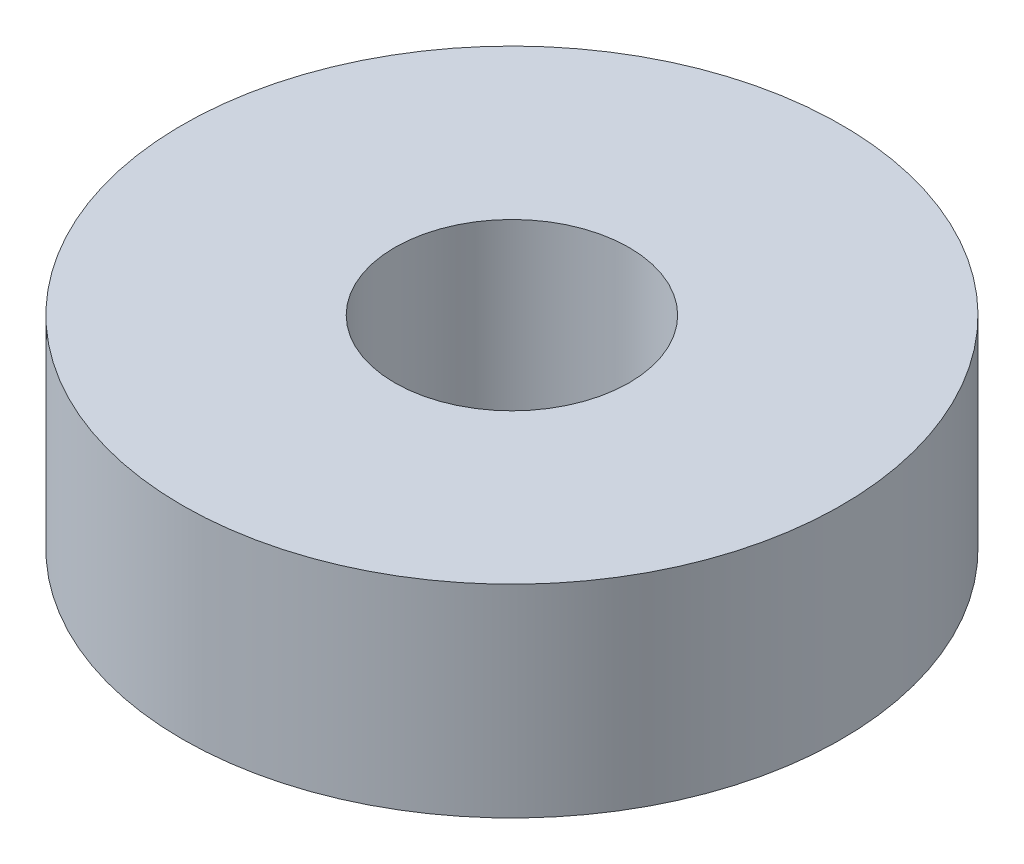
ISO-10303-21;
HEADER;
FILE_DESCRIPTION(('STEP AP214'),'2;1');
FILE_NAME('part.step','',(''),(''),'','','');
FILE_SCHEMA(('AUTOMOTIVE_DESIGN { 1 0 10303 214 1 1 1 1 }'));
ENDSEC;
DATA;
#1=APPLICATION_CONTEXT('core data for automotive mechanical design processes');
#2=APPLICATION_PROTOCOL_DEFINITION('international standard','automotive_design',2000,#1);
#3=PRODUCT_CONTEXT('',#1,'mechanical');
#4=PRODUCT('Part','Part','',(#3));
#5=PRODUCT_RELATED_PRODUCT_CATEGORY('part','',(#4));
#6=PRODUCT_DEFINITION_FORMATION('','',#4);
#7=PRODUCT_DEFINITION_CONTEXT('part definition',#1,'design');
#8=PRODUCT_DEFINITION('design','',#6,#7);
#9=PRODUCT_DEFINITION_SHAPE('','',#8);
#10=(LENGTH_UNIT() NAMED_UNIT(*) SI_UNIT(.MILLI.,.METRE.));
#11=(NAMED_UNIT(*) PLANE_ANGLE_UNIT() SI_UNIT($,.RADIAN.));
#12=(NAMED_UNIT(*) SI_UNIT($,.STERADIAN.) SOLID_ANGLE_UNIT());
#13=UNCERTAINTY_MEASURE_WITH_UNIT(LENGTH_MEASURE(1.E-05),#10,'distance_accuracy_value','');
#14=(GEOMETRIC_REPRESENTATION_CONTEXT(3) GLOBAL_UNCERTAINTY_ASSIGNED_CONTEXT((#13)) GLOBAL_UNIT_ASSIGNED_CONTEXT((#10,
#11,#12)) REPRESENTATION_CONTEXT('',''));
#15=CARTESIAN_POINT('',(0.,0.,0.));
#16=DIRECTION('',(0.,0.,1.));
#17=DIRECTION('',(1.,0.,0.));
#18=AXIS2_PLACEMENT_3D('',#15,#16,#17);
#19=CARTESIAN_POINT('',(0.,6.65,0.));
#20=DIRECTION('',(0.,1.,0.));
#21=DIRECTION('',(0.,0.,1.));
#22=AXIS2_PLACEMENT_3D('',#19,#20,#21);
#23=PLANE('',#22);
#24=CARTESIAN_POINT('',(0.,6.65,0.));
#25=DIRECTION('',(0.,1.,0.));
#26=DIRECTION('',(0.,0.,1.));
#27=AXIS2_PLACEMENT_3D('',#24,#25,#26);
#28=CIRCLE('',#27,10.825);
#29=CARTESIAN_POINT('',(0.,6.65,10.825));
#30=VERTEX_POINT('',#29);
#31=EDGE_CURVE('E10',#30,#30,#28,.T.);
#32=ORIENTED_EDGE('',*,*,#31,.T.);
#33=EDGE_LOOP('',(#32));
#34=FACE_BOUND('',#33,.T.);
#35=CARTESIAN_POINT('',(0.,6.65,0.));
#36=DIRECTION('',(0.,1.,0.));
#37=DIRECTION('',(0.,0.,1.));
#38=AXIS2_PLACEMENT_3D('',#35,#36,#37);
#39=CIRCLE('',#38,3.85);
#40=CARTESIAN_POINT('',(0.,6.65,3.85));
#41=VERTEX_POINT('',#40);
#42=EDGE_CURVE('E56',#41,#41,#39,.T.);
#43=ORIENTED_EDGE('',*,*,#42,.F.);
#44=EDGE_LOOP('',(#43));
#45=FACE_BOUND('',#44,.T.);
#46=ADVANCED_FACE('F43',(#34,#45),#23,.T.);
#47=CARTESIAN_POINT('',(0.,0.,0.));
#48=DIRECTION('',(0.,1.,0.));
#49=DIRECTION('',(0.,0.,1.));
#50=AXIS2_PLACEMENT_3D('',#47,#48,#49);
#51=PLANE('',#50);
#52=CARTESIAN_POINT('',(0.,0.,0.));
#53=DIRECTION('',(0.,1.,0.));
#54=DIRECTION('',(0.,0.,1.));
#55=AXIS2_PLACEMENT_3D('',#52,#53,#54);
#56=CIRCLE('',#55,10.825);
#57=CARTESIAN_POINT('',(0.,0.,10.825));
#58=VERTEX_POINT('',#57);
#59=EDGE_CURVE('E47',#58,#58,#56,.T.);
#60=ORIENTED_EDGE('',*,*,#59,.F.);
#61=EDGE_LOOP('',(#60));
#62=FACE_BOUND('',#61,.T.);
#63=CARTESIAN_POINT('',(0.,0.,0.));
#64=DIRECTION('',(0.,1.,0.));
#65=DIRECTION('',(0.,0.,1.));
#66=AXIS2_PLACEMENT_3D('',#63,#64,#65);
#67=CIRCLE('',#66,3.85);
#68=CARTESIAN_POINT('',(0.,0.,3.85));
#69=VERTEX_POINT('',#68);
#70=EDGE_CURVE('E58',#69,#69,#67,.T.);
#71=ORIENTED_EDGE('',*,*,#70,.T.);
#72=EDGE_LOOP('',(#71));
#73=FACE_BOUND('',#72,.T.);
#74=ADVANCED_FACE('F70',(#62,#73),#51,.F.);
#75=CARTESIAN_POINT('',(0.,6.65,0.));
#76=DIRECTION('',(0.,-1.,0.));
#77=DIRECTION('',(0.,0.,-1.));
#78=AXIS2_PLACEMENT_3D('',#75,#76,#77);
#79=CYLINDRICAL_SURFACE('',#78,10.825);
#80=ORIENTED_EDGE('',*,*,#31,.F.);
#81=EDGE_LOOP('',(#80));
#82=FACE_BOUND('',#81,.T.);
#83=ORIENTED_EDGE('',*,*,#59,.T.);
#84=EDGE_LOOP('',(#83));
#85=FACE_BOUND('',#84,.T.);
#86=ADVANCED_FACE('F45',(#82,#85),#79,.T.);
#87=CARTESIAN_POINT('',(0.,6.65,0.));
#88=DIRECTION('',(0.,-1.,0.));
#89=DIRECTION('',(0.,0.,-1.));
#90=AXIS2_PLACEMENT_3D('',#87,#88,#89);
#91=CYLINDRICAL_SURFACE('',#90,3.85);
#92=ORIENTED_EDGE('',*,*,#42,.T.);
#93=EDGE_LOOP('',(#92));
#94=FACE_BOUND('',#93,.T.);
#95=ORIENTED_EDGE('',*,*,#70,.F.);
#96=EDGE_LOOP('',(#95));
#97=FACE_BOUND('',#96,.T.);
#98=ADVANCED_FACE('F66',(#94,#97),#91,.F.);
#99=CLOSED_SHELL('',(#46,#74,#86,#98));
#100=MANIFOLD_SOLID_BREP('B2',#99);
#101=ADVANCED_BREP_SHAPE_REPRESENTATION('',(#18,#100),#14);
#102=SHAPE_DEFINITION_REPRESENTATION(#9,#101);
ENDSEC;
END-ISO-10303-21;
